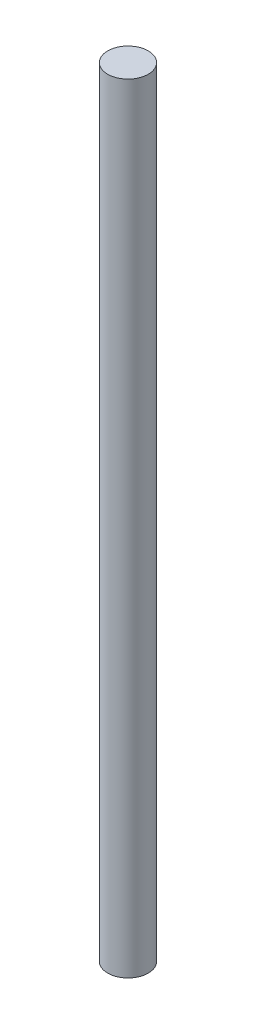
ISO-10303-21;
HEADER;
FILE_DESCRIPTION(('STEP AP214'),'2;1');
FILE_NAME('part.step','',(''),(''),'','','');
FILE_SCHEMA(('AUTOMOTIVE_DESIGN { 1 0 10303 214 1 1 1 1 }'));
ENDSEC;
DATA;
#1=APPLICATION_CONTEXT('core data for automotive mechanical design processes');
#2=APPLICATION_PROTOCOL_DEFINITION('international standard','automotive_design',2000,#1);
#3=PRODUCT_CONTEXT('',#1,'mechanical');
#4=PRODUCT('Part','Part','',(#3));
#5=PRODUCT_RELATED_PRODUCT_CATEGORY('part','',(#4));
#6=PRODUCT_DEFINITION_FORMATION('','',#4);
#7=PRODUCT_DEFINITION_CONTEXT('part definition',#1,'design');
#8=PRODUCT_DEFINITION('design','',#6,#7);
#9=PRODUCT_DEFINITION_SHAPE('','',#8);
#10=(LENGTH_UNIT() NAMED_UNIT(*) SI_UNIT(.MILLI.,.METRE.));
#11=(NAMED_UNIT(*) PLANE_ANGLE_UNIT() SI_UNIT($,.RADIAN.));
#12=(NAMED_UNIT(*) SI_UNIT($,.STERADIAN.) SOLID_ANGLE_UNIT());
#13=UNCERTAINTY_MEASURE_WITH_UNIT(LENGTH_MEASURE(1.E-05),#10,'distance_accuracy_value','');
#14=(GEOMETRIC_REPRESENTATION_CONTEXT(3) GLOBAL_UNCERTAINTY_ASSIGNED_CONTEXT((#13)) GLOBAL_UNIT_ASSIGNED_CONTEXT((#10,
#11,#12)) REPRESENTATION_CONTEXT('',''));
#15=CARTESIAN_POINT('',(0.,0.,0.));
#16=DIRECTION('',(0.,0.,1.));
#17=DIRECTION('',(1.,0.,0.));
#18=AXIS2_PLACEMENT_3D('',#15,#16,#17);
#19=CARTESIAN_POINT('',(0.,609.6,0.));
#20=DIRECTION('',(0.,-1.,0.));
#21=DIRECTION('',(0.,0.,-1.));
#22=AXIS2_PLACEMENT_3D('',#19,#20,#21);
#23=CYLINDRICAL_SURFACE('',#22,15.875);
#24=CARTESIAN_POINT('',(0.,609.6,0.));
#25=DIRECTION('',(0.,1.,0.));
#26=DIRECTION('',(0.,0.,1.));
#27=AXIS2_PLACEMENT_3D('',#24,#25,#26);
#28=CIRCLE('',#27,15.875);
#29=CARTESIAN_POINT('',(0.,609.6,15.875));
#30=VERTEX_POINT('',#29);
#31=EDGE_CURVE('E10',#30,#30,#28,.T.);
#32=ORIENTED_EDGE('',*,*,#31,.F.);
#33=EDGE_LOOP('',(#32));
#34=FACE_BOUND('',#33,.T.);
#35=CARTESIAN_POINT('',(0.,0.,0.));
#36=DIRECTION('',(0.,1.,0.));
#37=DIRECTION('',(0.,0.,1.));
#38=AXIS2_PLACEMENT_3D('',#35,#36,#37);
#39=CIRCLE('',#38,15.875);
#40=CARTESIAN_POINT('',(0.,0.,15.875));
#41=VERTEX_POINT('',#40);
#42=EDGE_CURVE('E37',#41,#41,#39,.T.);
#43=ORIENTED_EDGE('',*,*,#42,.T.);
#44=EDGE_LOOP('',(#43));
#45=FACE_BOUND('',#44,.T.);
#46=ADVANCED_FACE('F34',(#34,#45),#23,.T.);
#47=CARTESIAN_POINT('',(0.,609.6,0.));
#48=DIRECTION('',(0.,1.,0.));
#49=DIRECTION('',(0.,0.,1.));
#50=AXIS2_PLACEMENT_3D('',#47,#48,#49);
#51=PLANE('',#50);
#52=ORIENTED_EDGE('',*,*,#31,.T.);
#53=EDGE_LOOP('',(#52));
#54=FACE_BOUND('',#53,.T.);
#55=ADVANCED_FACE('F49',(#54),#51,.T.);
#56=CARTESIAN_POINT('',(0.,0.,0.));
#57=DIRECTION('',(0.,1.,0.));
#58=DIRECTION('',(0.,0.,1.));
#59=AXIS2_PLACEMENT_3D('',#56,#57,#58);
#60=PLANE('',#59);
#61=ORIENTED_EDGE('',*,*,#42,.F.);
#62=EDGE_LOOP('',(#61));
#63=FACE_BOUND('',#62,.T.);
#64=ADVANCED_FACE('F47',(#63),#60,.F.);
#65=CLOSED_SHELL('',(#46,#55,#64));
#66=MANIFOLD_SOLID_BREP('B2',#65);
#67=ADVANCED_BREP_SHAPE_REPRESENTATION('',(#18,#66),#14);
#68=SHAPE_DEFINITION_REPRESENTATION(#9,#67);
ENDSEC;
END-ISO-10303-21;
